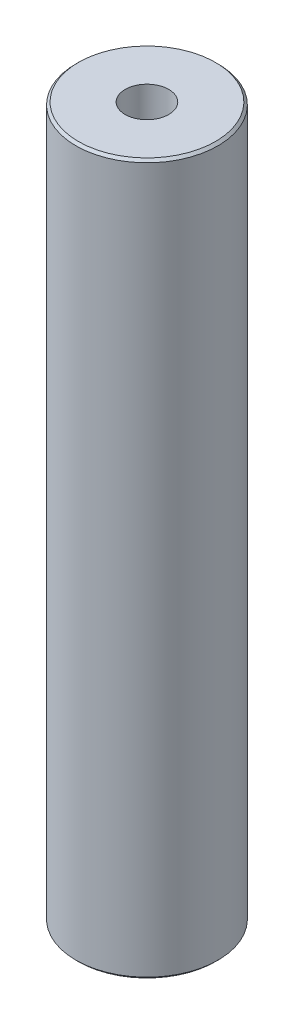
ISO-10303-21;
HEADER;
FILE_DESCRIPTION(('STEP AP214'),'2;1');
FILE_NAME('part.step','',(''),(''),'','','');
FILE_SCHEMA(('AUTOMOTIVE_DESIGN { 1 0 10303 214 1 1 1 1 }'));
ENDSEC;
DATA;
#1=APPLICATION_CONTEXT('core data for automotive mechanical design processes');
#2=APPLICATION_PROTOCOL_DEFINITION('international standard','automotive_design',2000,#1);
#3=PRODUCT_CONTEXT('',#1,'mechanical');
#4=PRODUCT('Part','Part','',(#3));
#5=PRODUCT_RELATED_PRODUCT_CATEGORY('part','',(#4));
#6=PRODUCT_DEFINITION_FORMATION('','',#4);
#7=PRODUCT_DEFINITION_CONTEXT('part definition',#1,'design');
#8=PRODUCT_DEFINITION('design','',#6,#7);
#9=PRODUCT_DEFINITION_SHAPE('','',#8);
#10=(LENGTH_UNIT() NAMED_UNIT(*) SI_UNIT(.MILLI.,.METRE.));
#11=(NAMED_UNIT(*) PLANE_ANGLE_UNIT() SI_UNIT($,.RADIAN.));
#12=(NAMED_UNIT(*) SI_UNIT($,.STERADIAN.) SOLID_ANGLE_UNIT());
#13=UNCERTAINTY_MEASURE_WITH_UNIT(LENGTH_MEASURE(1.E-05),#10,'distance_accuracy_value','');
#14=(GEOMETRIC_REPRESENTATION_CONTEXT(3) GLOBAL_UNCERTAINTY_ASSIGNED_CONTEXT((#13)) GLOBAL_UNIT_ASSIGNED_CONTEXT((#10,
#11,#12)) REPRESENTATION_CONTEXT('',''));
#15=CARTESIAN_POINT('',(0.,0.,0.));
#16=DIRECTION('',(0.,0.,1.));
#17=DIRECTION('',(1.,0.,0.));
#18=AXIS2_PLACEMENT_3D('',#15,#16,#17);
#19=CARTESIAN_POINT('',(0.,600.,0.));
#20=DIRECTION('',(0.,-1.,0.));
#21=DIRECTION('',(0.,0.,-1.));
#22=AXIS2_PLACEMENT_3D('',#19,#20,#21);
#23=CYLINDRICAL_SURFACE('',#22,60.);
#24=CARTESIAN_POINT('',(0.,597.906295388673,0.));
#25=DIRECTION('',(0.,1.,0.));
#26=DIRECTION('',(0.,0.,1.));
#27=AXIS2_PLACEMENT_3D('',#24,#25,#26);
#28=CIRCLE('',#27,60.);
#29=CARTESIAN_POINT('',(0.,597.906295388673,60.));
#30=VERTEX_POINT('',#29);
#31=EDGE_CURVE('E50',#30,#30,#28,.F.);
#32=ORIENTED_EDGE('',*,*,#31,.T.);
#33=EDGE_LOOP('',(#32));
#34=FACE_BOUND('',#33,.T.);
#35=CARTESIAN_POINT('',(0.,2.0937046113263,0.));
#36=DIRECTION('',(0.,1.,0.));
#37=DIRECTION('',(0.,0.,1.));
#38=AXIS2_PLACEMENT_3D('',#35,#36,#37);
#39=CIRCLE('',#38,60.);
#40=CARTESIAN_POINT('',(0.,2.0937046113263,60.));
#41=VERTEX_POINT('',#40);
#42=EDGE_CURVE('E51',#41,#41,#39,.T.);
#43=ORIENTED_EDGE('',*,*,#42,.T.);
#44=EDGE_LOOP('',(#43));
#45=FACE_BOUND('',#44,.T.);
#46=ADVANCED_FACE('F39',(#34,#45),#23,.T.);
#47=CARTESIAN_POINT('',(0.,600.,0.));
#48=DIRECTION('',(0.,1.,0.));
#49=DIRECTION('',(0.,0.,1.));
#50=AXIS2_PLACEMENT_3D('',#47,#48,#49);
#51=PLANE('',#50);
#52=CARTESIAN_POINT('',(0.,600.,0.));
#53=DIRECTION('',(0.,1.,0.));
#54=DIRECTION('',(0.,0.,1.));
#55=AXIS2_PLACEMENT_3D('',#52,#53,#54);
#56=CIRCLE('',#55,57.9062953886735);
#57=CARTESIAN_POINT('',(0.,600.,57.9062953886735));
#58=VERTEX_POINT('',#57);
#59=EDGE_CURVE('E54',#58,#58,#56,.T.);
#60=ORIENTED_EDGE('',*,*,#59,.T.);
#61=EDGE_LOOP('',(#60));
#62=FACE_BOUND('',#61,.T.);
#63=CARTESIAN_POINT('',(0.,600.,0.));
#64=DIRECTION('',(0.,1.,0.));
#65=DIRECTION('',(0.,0.,1.));
#66=AXIS2_PLACEMENT_3D('',#63,#64,#65);
#67=CIRCLE('',#66,18.4169180063619);
#68=CARTESIAN_POINT('',(0.,600.,18.4169180063619));
#69=VERTEX_POINT('',#68);
#70=EDGE_CURVE('E58',#69,#69,#67,.T.);
#71=ORIENTED_EDGE('',*,*,#70,.F.);
#72=EDGE_LOOP('',(#71));
#73=FACE_BOUND('',#72,.T.);
#74=ADVANCED_FACE('F69',(#62,#73),#51,.T.);
#75=CARTESIAN_POINT('',(0.,0.,0.));
#76=DIRECTION('',(0.,1.,0.));
#77=DIRECTION('',(0.,0.,1.));
#78=AXIS2_PLACEMENT_3D('',#75,#76,#77);
#79=PLANE('',#78);
#80=CARTESIAN_POINT('',(0.,0.,0.));
#81=DIRECTION('',(0.,1.,0.));
#82=DIRECTION('',(0.,0.,1.));
#83=AXIS2_PLACEMENT_3D('',#80,#81,#82);
#84=CIRCLE('',#83,57.9062953886736);
#85=CARTESIAN_POINT('',(0.,0.,57.9062953886736));
#86=VERTEX_POINT('',#85);
#87=EDGE_CURVE('E10',#86,#86,#84,.F.);
#88=ORIENTED_EDGE('',*,*,#87,.T.);
#89=EDGE_LOOP('',(#88));
#90=FACE_BOUND('',#89,.T.);
#91=CARTESIAN_POINT('',(0.,0.,0.));
#92=DIRECTION('',(0.,1.,0.));
#93=DIRECTION('',(0.,0.,1.));
#94=AXIS2_PLACEMENT_3D('',#91,#92,#93);
#95=CIRCLE('',#94,18.4169180063619);
#96=CARTESIAN_POINT('',(0.,0.,18.4169180063619));
#97=VERTEX_POINT('',#96);
#98=EDGE_CURVE('E63',#97,#97,#95,.T.);
#99=ORIENTED_EDGE('',*,*,#98,.T.);
#100=EDGE_LOOP('',(#99));
#101=FACE_BOUND('',#100,.T.);
#102=ADVANCED_FACE('F75',(#90,#101),#79,.F.);
#103=CARTESIAN_POINT('',(0.,600.,0.));
#104=DIRECTION('',(0.,-1.,0.));
#105=DIRECTION('',(0.,0.,-1.));
#106=AXIS2_PLACEMENT_3D('',#103,#104,#105);
#107=CYLINDRICAL_SURFACE('',#106,18.4169180063619);
#108=ORIENTED_EDGE('',*,*,#70,.T.);
#109=EDGE_LOOP('',(#108));
#110=FACE_BOUND('',#109,.T.);
#111=ORIENTED_EDGE('',*,*,#98,.F.);
#112=EDGE_LOOP('',(#111));
#113=FACE_BOUND('',#112,.T.);
#114=ADVANCED_FACE('F70',(#110,#113),#107,.F.);
#115=CARTESIAN_POINT('',(0.,600.,0.));
#116=DIRECTION('',(0.,-1.,0.));
#117=DIRECTION('',(0.,0.,-1.));
#118=AXIS2_PLACEMENT_3D('',#115,#116,#117);
#119=CONICAL_SURFACE('',#118,57.9062953886735,0.785398163397448);
#120=ORIENTED_EDGE('',*,*,#31,.F.);
#121=EDGE_LOOP('',(#120));
#122=FACE_BOUND('',#121,.T.);
#123=ORIENTED_EDGE('',*,*,#59,.F.);
#124=EDGE_LOOP('',(#123));
#125=FACE_BOUND('',#124,.T.);
#126=ADVANCED_FACE('F81',(#122,#125),#119,.T.);
#127=CARTESIAN_POINT('',(0.,2.0937046113263,0.));
#128=DIRECTION('',(0.,1.,0.));
#129=DIRECTION('',(0.,0.,1.));
#130=AXIS2_PLACEMENT_3D('',#127,#128,#129);
#131=CONICAL_SURFACE('',#130,60.,0.785398163397462);
#132=ORIENTED_EDGE('',*,*,#87,.F.);
#133=EDGE_LOOP('',(#132));
#134=FACE_BOUND('',#133,.T.);
#135=ORIENTED_EDGE('',*,*,#42,.F.);
#136=EDGE_LOOP('',(#135));
#137=FACE_BOUND('',#136,.T.);
#138=ADVANCED_FACE('F45',(#134,#137),#131,.T.);
#139=CLOSED_SHELL('',(#46,#74,#102,#114,#126,#138));
#140=MANIFOLD_SOLID_BREP('B2',#139);
#141=ADVANCED_BREP_SHAPE_REPRESENTATION('',(#18,#140),#14);
#142=SHAPE_DEFINITION_REPRESENTATION(#9,#141);
ENDSEC;
END-ISO-10303-21;
